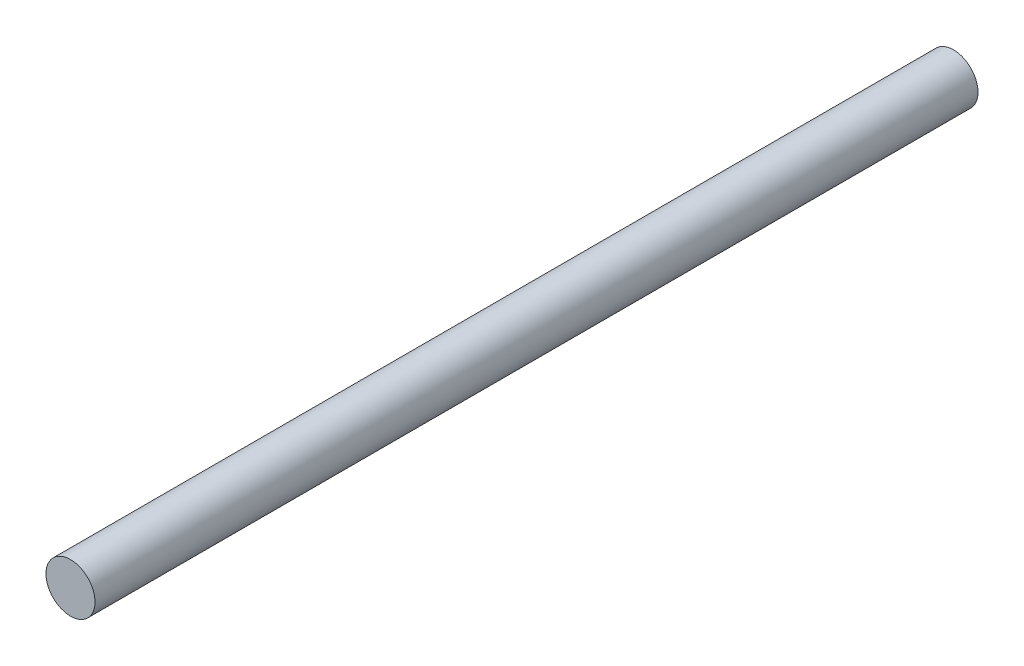
ISO-10303-21;
HEADER;
FILE_DESCRIPTION(('STEP AP214'),'2;1');
FILE_NAME('part.step','',(''),(''),'','','');
FILE_SCHEMA(('AUTOMOTIVE_DESIGN { 1 0 10303 214 1 1 1 1 }'));
ENDSEC;
DATA;
#1=APPLICATION_CONTEXT('core data for automotive mechanical design processes');
#2=APPLICATION_PROTOCOL_DEFINITION('international standard','automotive_design',2000,#1);
#3=PRODUCT_CONTEXT('',#1,'mechanical');
#4=PRODUCT('Part','Part','',(#3));
#5=PRODUCT_RELATED_PRODUCT_CATEGORY('part','',(#4));
#6=PRODUCT_DEFINITION_FORMATION('','',#4);
#7=PRODUCT_DEFINITION_CONTEXT('part definition',#1,'design');
#8=PRODUCT_DEFINITION('design','',#6,#7);
#9=PRODUCT_DEFINITION_SHAPE('','',#8);
#10=(LENGTH_UNIT() NAMED_UNIT(*) SI_UNIT(.MILLI.,.METRE.));
#11=(NAMED_UNIT(*) PLANE_ANGLE_UNIT() SI_UNIT($,.RADIAN.));
#12=(NAMED_UNIT(*) SI_UNIT($,.STERADIAN.) SOLID_ANGLE_UNIT());
#13=UNCERTAINTY_MEASURE_WITH_UNIT(LENGTH_MEASURE(1.E-05),#10,'distance_accuracy_value','');
#14=(GEOMETRIC_REPRESENTATION_CONTEXT(3) GLOBAL_UNCERTAINTY_ASSIGNED_CONTEXT((#13)) GLOBAL_UNIT_ASSIGNED_CONTEXT((#10,
#11,#12)) REPRESENTATION_CONTEXT('',''));
#15=CARTESIAN_POINT('',(0.,0.,0.));
#16=DIRECTION('',(0.,0.,1.));
#17=DIRECTION('',(1.,0.,0.));
#18=AXIS2_PLACEMENT_3D('',#15,#16,#17);
#19=CARTESIAN_POINT('',(-4.68963563192314E-12,-2.97657169413375E-13,-15.920826900499));
#20=DIRECTION('',(0.,0.,1.));
#21=DIRECTION('',(1.,0.,0.));
#22=AXIS2_PLACEMENT_3D('',#19,#20,#21);
#23=CYLINDRICAL_SURFACE('',#22,3.175);
#24=CARTESIAN_POINT('',(-4.68963563192314E-12,-2.97657169413375E-13,-15.920826900499));
#25=DIRECTION('',(0.,0.,1.));
#26=DIRECTION('',(1.,0.,0.));
#27=AXIS2_PLACEMENT_3D('',#24,#25,#26);
#28=CIRCLE('',#27,3.175);
#29=CARTESIAN_POINT('',(3.17499999999531,-2.97657169413375E-13,-15.920826900499));
#30=VERTEX_POINT('',#29);
#31=EDGE_CURVE('E11',#30,#30,#28,.T.);
#32=ORIENTED_EDGE('',*,*,#31,.T.);
#33=EDGE_LOOP('',(#32));
#34=FACE_BOUND('',#33,.T.);
#35=CARTESIAN_POINT('',(-4.68963563192314E-12,-2.97657169413375E-13,98.379173099501));
#36=DIRECTION('',(0.,0.,1.));
#37=DIRECTION('',(1.,0.,0.));
#38=AXIS2_PLACEMENT_3D('',#35,#36,#37);
#39=CIRCLE('',#38,3.175);
#40=CARTESIAN_POINT('',(3.17499999999531,-2.97657169413375E-13,98.379173099501));
#41=VERTEX_POINT('',#40);
#42=EDGE_CURVE('E48',#41,#41,#39,.T.);
#43=ORIENTED_EDGE('',*,*,#42,.F.);
#44=EDGE_LOOP('',(#43));
#45=FACE_BOUND('',#44,.T.);
#46=ADVANCED_FACE('F45',(#34,#45),#23,.T.);
#47=CARTESIAN_POINT('',(-4.68963563192314E-12,-2.97657169413375E-13,-15.920826900499));
#48=DIRECTION('',(0.,0.,1.));
#49=DIRECTION('',(1.,0.,0.));
#50=AXIS2_PLACEMENT_3D('',#47,#48,#49);
#51=PLANE('',#50);
#52=ORIENTED_EDGE('',*,*,#31,.F.);
#53=EDGE_LOOP('',(#52));
#54=FACE_BOUND('',#53,.T.);
#55=ADVANCED_FACE('F60',(#54),#51,.F.);
#56=CARTESIAN_POINT('',(-4.68963563192314E-12,-2.97657169413375E-13,98.379173099501));
#57=DIRECTION('',(0.,0.,1.));
#58=DIRECTION('',(1.,0.,0.));
#59=AXIS2_PLACEMENT_3D('',#56,#57,#58);
#60=PLANE('',#59);
#61=ORIENTED_EDGE('',*,*,#42,.T.);
#62=EDGE_LOOP('',(#61));
#63=FACE_BOUND('',#62,.T.);
#64=ADVANCED_FACE('F57',(#63),#60,.T.);
#65=CLOSED_SHELL('',(#46,#55,#64));
#66=MANIFOLD_SOLID_BREP('B2',#65);
#67=ADVANCED_BREP_SHAPE_REPRESENTATION('',(#18,#66),#14);
#68=SHAPE_DEFINITION_REPRESENTATION(#9,#67);
ENDSEC;
END-ISO-10303-21;
